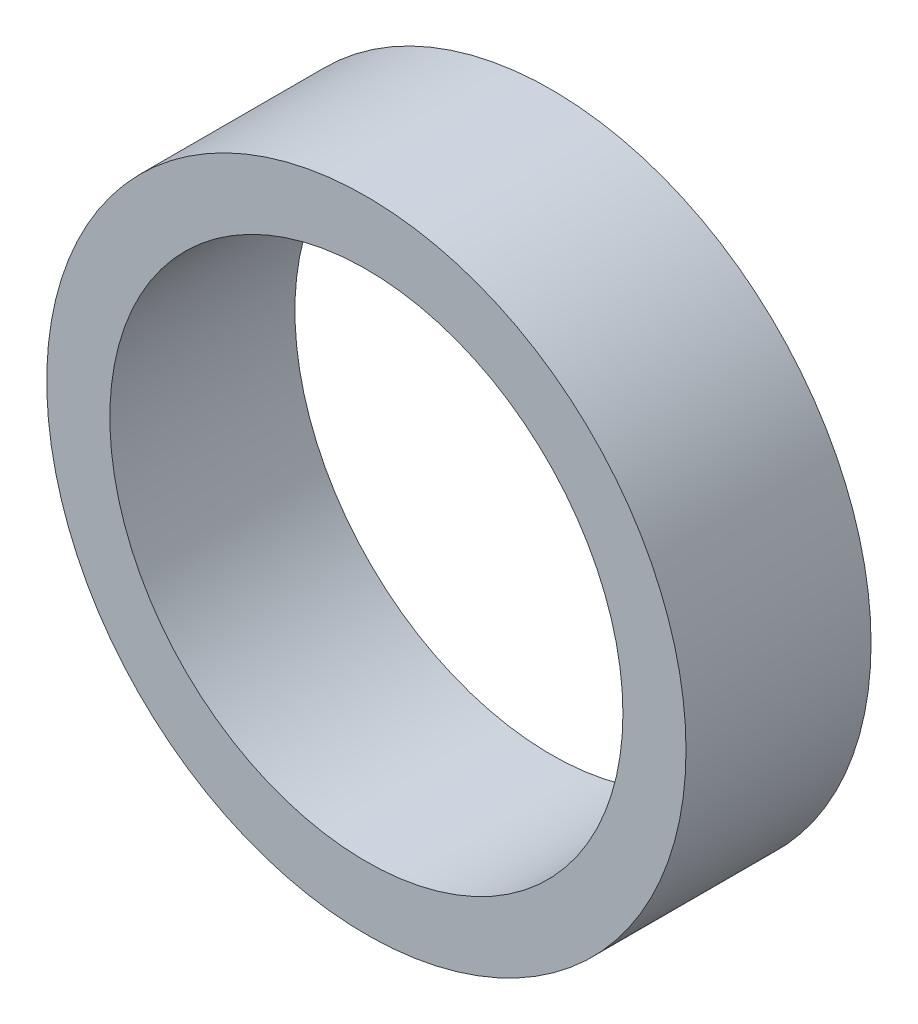
ISO-10303-21;
HEADER;
FILE_DESCRIPTION(('STEP AP214'),'2;1');
FILE_NAME('part.step','',(''),(''),'','','');
FILE_SCHEMA(('AUTOMOTIVE_DESIGN { 1 0 10303 214 1 1 1 1 }'));
ENDSEC;
DATA;
#1=APPLICATION_CONTEXT('core data for automotive mechanical design processes');
#2=APPLICATION_PROTOCOL_DEFINITION('international standard','automotive_design',2000,#1);
#3=PRODUCT_CONTEXT('',#1,'mechanical');
#4=PRODUCT('Part','Part','',(#3));
#5=PRODUCT_RELATED_PRODUCT_CATEGORY('part','',(#4));
#6=PRODUCT_DEFINITION_FORMATION('','',#4);
#7=PRODUCT_DEFINITION_CONTEXT('part definition',#1,'design');
#8=PRODUCT_DEFINITION('design','',#6,#7);
#9=PRODUCT_DEFINITION_SHAPE('','',#8);
#10=(LENGTH_UNIT() NAMED_UNIT(*) SI_UNIT(.MILLI.,.METRE.));
#11=(NAMED_UNIT(*) PLANE_ANGLE_UNIT() SI_UNIT($,.RADIAN.));
#12=(NAMED_UNIT(*) SI_UNIT($,.STERADIAN.) SOLID_ANGLE_UNIT());
#13=UNCERTAINTY_MEASURE_WITH_UNIT(LENGTH_MEASURE(1.E-05),#10,'distance_accuracy_value','');
#14=(GEOMETRIC_REPRESENTATION_CONTEXT(3) GLOBAL_UNCERTAINTY_ASSIGNED_CONTEXT((#13)) GLOBAL_UNIT_ASSIGNED_CONTEXT((#10,
#11,#12)) REPRESENTATION_CONTEXT('',''));
#15=CARTESIAN_POINT('',(0.,0.,0.));
#16=DIRECTION('',(0.,0.,1.));
#17=DIRECTION('',(1.,0.,0.));
#18=AXIS2_PLACEMENT_3D('',#15,#16,#17);
#19=CARTESIAN_POINT('',(0.,0.,11.));
#20=DIRECTION('',(0.,0.,1.));
#21=DIRECTION('',(1.,0.,0.));
#22=AXIS2_PLACEMENT_3D('',#19,#20,#21);
#23=PLANE('',#22);
#24=CARTESIAN_POINT('',(0.,0.,11.));
#25=DIRECTION('',(0.,0.,1.));
#26=DIRECTION('',(1.,0.,0.));
#27=AXIS2_PLACEMENT_3D('',#24,#25,#26);
#28=CIRCLE('',#27,19.);
#29=CARTESIAN_POINT('',(19.,0.,11.));
#30=VERTEX_POINT('',#29);
#31=EDGE_CURVE('E10',#30,#30,#28,.T.);
#32=ORIENTED_EDGE('',*,*,#31,.T.);
#33=EDGE_LOOP('',(#32));
#34=FACE_BOUND('',#33,.T.);
#35=CARTESIAN_POINT('',(0.,0.,11.));
#36=DIRECTION('',(0.,0.,1.));
#37=DIRECTION('',(1.,0.,0.));
#38=AXIS2_PLACEMENT_3D('',#35,#36,#37);
#39=CIRCLE('',#38,15.25);
#40=CARTESIAN_POINT('',(15.25,0.,11.));
#41=VERTEX_POINT('',#40);
#42=EDGE_CURVE('E50',#41,#41,#39,.T.);
#43=ORIENTED_EDGE('',*,*,#42,.F.);
#44=EDGE_LOOP('',(#43));
#45=FACE_BOUND('',#44,.T.);
#46=ADVANCED_FACE('F37',(#34,#45),#23,.T.);
#47=CARTESIAN_POINT('',(0.,0.,0.));
#48=DIRECTION('',(0.,0.,1.));
#49=DIRECTION('',(1.,0.,0.));
#50=AXIS2_PLACEMENT_3D('',#47,#48,#49);
#51=PLANE('',#50);
#52=CARTESIAN_POINT('',(0.,0.,0.));
#53=DIRECTION('',(0.,0.,1.));
#54=DIRECTION('',(1.,0.,0.));
#55=AXIS2_PLACEMENT_3D('',#52,#53,#54);
#56=CIRCLE('',#55,19.);
#57=CARTESIAN_POINT('',(19.,0.,0.));
#58=VERTEX_POINT('',#57);
#59=EDGE_CURVE('E41',#58,#58,#56,.T.);
#60=ORIENTED_EDGE('',*,*,#59,.F.);
#61=EDGE_LOOP('',(#60));
#62=FACE_BOUND('',#61,.T.);
#63=CARTESIAN_POINT('',(0.,0.,0.));
#64=DIRECTION('',(0.,0.,1.));
#65=DIRECTION('',(1.,0.,0.));
#66=AXIS2_PLACEMENT_3D('',#63,#64,#65);
#67=CIRCLE('',#66,15.25);
#68=CARTESIAN_POINT('',(15.25,0.,0.));
#69=VERTEX_POINT('',#68);
#70=EDGE_CURVE('E52',#69,#69,#67,.T.);
#71=ORIENTED_EDGE('',*,*,#70,.T.);
#72=EDGE_LOOP('',(#71));
#73=FACE_BOUND('',#72,.T.);
#74=ADVANCED_FACE('F64',(#62,#73),#51,.F.);
#75=CARTESIAN_POINT('',(0.,0.,11.));
#76=DIRECTION('',(0.,0.,-1.));
#77=DIRECTION('',(-1.,0.,0.));
#78=AXIS2_PLACEMENT_3D('',#75,#76,#77);
#79=CYLINDRICAL_SURFACE('',#78,19.);
#80=ORIENTED_EDGE('',*,*,#31,.F.);
#81=EDGE_LOOP('',(#80));
#82=FACE_BOUND('',#81,.T.);
#83=ORIENTED_EDGE('',*,*,#59,.T.);
#84=EDGE_LOOP('',(#83));
#85=FACE_BOUND('',#84,.T.);
#86=ADVANCED_FACE('F39',(#82,#85),#79,.T.);
#87=CARTESIAN_POINT('',(0.,0.,11.));
#88=DIRECTION('',(0.,0.,-1.));
#89=DIRECTION('',(-1.,0.,0.));
#90=AXIS2_PLACEMENT_3D('',#87,#88,#89);
#91=CYLINDRICAL_SURFACE('',#90,15.25);
#92=ORIENTED_EDGE('',*,*,#42,.T.);
#93=EDGE_LOOP('',(#92));
#94=FACE_BOUND('',#93,.T.);
#95=ORIENTED_EDGE('',*,*,#70,.F.);
#96=EDGE_LOOP('',(#95));
#97=FACE_BOUND('',#96,.T.);
#98=ADVANCED_FACE('F60',(#94,#97),#91,.F.);
#99=CLOSED_SHELL('',(#46,#74,#86,#98));
#100=MANIFOLD_SOLID_BREP('B2',#99);
#101=ADVANCED_BREP_SHAPE_REPRESENTATION('',(#18,#100),#14);
#102=SHAPE_DEFINITION_REPRESENTATION(#9,#101);
ENDSEC;
END-ISO-10303-21;
